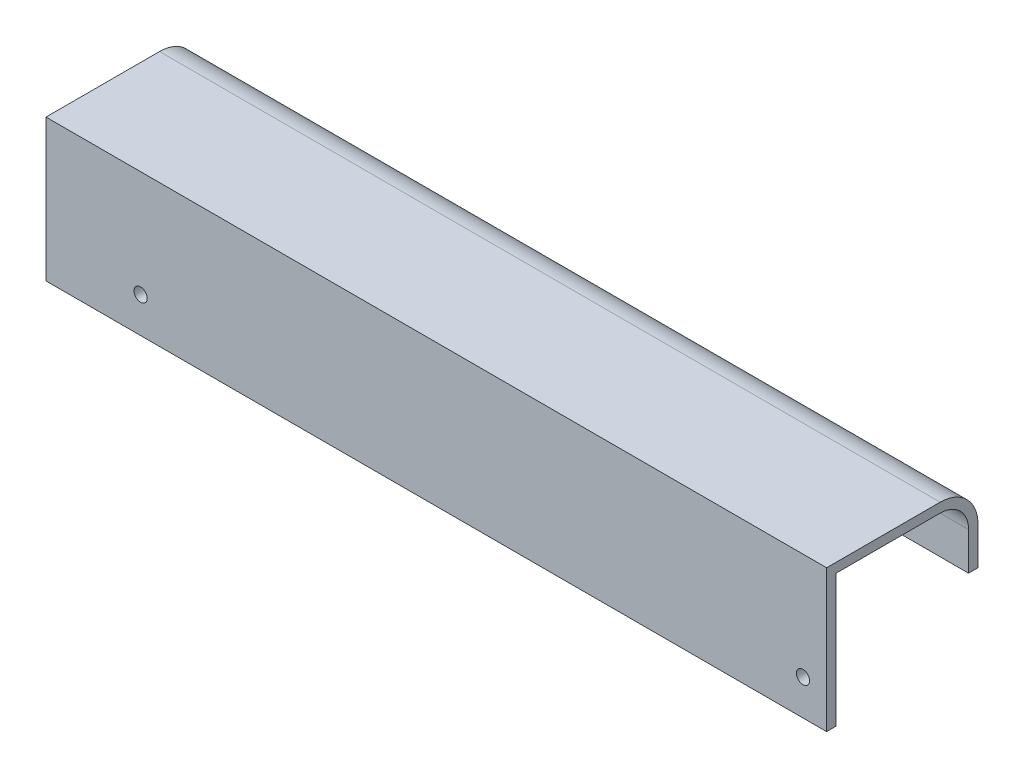
ISO-10303-21;
HEADER;
FILE_DESCRIPTION(('STEP AP214'),'2;1');
FILE_NAME('part.step','',(''),(''),'','','');
FILE_SCHEMA(('AUTOMOTIVE_DESIGN { 1 0 10303 214 1 1 1 1 }'));
ENDSEC;
DATA;
#1=APPLICATION_CONTEXT('core data for automotive mechanical design processes');
#2=APPLICATION_PROTOCOL_DEFINITION('international standard','automotive_design',2000,#1);
#3=PRODUCT_CONTEXT('',#1,'mechanical');
#4=PRODUCT('Part','Part','',(#3));
#5=PRODUCT_RELATED_PRODUCT_CATEGORY('part','',(#4));
#6=PRODUCT_DEFINITION_FORMATION('','',#4);
#7=PRODUCT_DEFINITION_CONTEXT('part definition',#1,'design');
#8=PRODUCT_DEFINITION('design','',#6,#7);
#9=PRODUCT_DEFINITION_SHAPE('','',#8);
#10=(LENGTH_UNIT() NAMED_UNIT(*) SI_UNIT(.MILLI.,.METRE.));
#11=(NAMED_UNIT(*) PLANE_ANGLE_UNIT() SI_UNIT($,.RADIAN.));
#12=(NAMED_UNIT(*) SI_UNIT($,.STERADIAN.) SOLID_ANGLE_UNIT());
#13=UNCERTAINTY_MEASURE_WITH_UNIT(LENGTH_MEASURE(1.E-05),#10,'distance_accuracy_value','');
#14=(GEOMETRIC_REPRESENTATION_CONTEXT(3) GLOBAL_UNCERTAINTY_ASSIGNED_CONTEXT((#13)) GLOBAL_UNIT_ASSIGNED_CONTEXT((#10,
#11,#12)) REPRESENTATION_CONTEXT('',''));
#15=CARTESIAN_POINT('',(0.,0.,0.));
#16=DIRECTION('',(0.,0.,1.));
#17=DIRECTION('',(1.,0.,0.));
#18=AXIS2_PLACEMENT_3D('',#15,#16,#17);
#19=CARTESIAN_POINT('',(-139.7,10.16,-35.56));
#20=DIRECTION('',(0.,0.,-1.));
#21=DIRECTION('',(0.,1.,0.));
#22=AXIS2_PLACEMENT_3D('',#19,#20,#21);
#23=PLANE('',#22);
#24=DIRECTION('',(0.,-1.,0.));
#25=VECTOR('',#24,1.);
#26=CARTESIAN_POINT('',(-190.5,10.16,-35.56));
#27=LINE('',#26,#25);
#28=CARTESIAN_POINT('',(-190.5,10.16,-35.56));
#29=VERTEX_POINT('',#28);
#30=CARTESIAN_POINT('',(-190.5,0.,-35.56));
#31=VERTEX_POINT('',#30);
#32=EDGE_CURVE('E140',#29,#31,#27,.T.);
#33=ORIENTED_EDGE('',*,*,#32,.F.);
#34=DIRECTION('',(-1.,0.,0.));
#35=VECTOR('',#34,1.);
#36=CARTESIAN_POINT('',(-139.7,10.16,-35.56));
#37=LINE('',#36,#35);
#38=CARTESIAN_POINT('',(-139.7,10.16,-35.56));
#39=VERTEX_POINT('',#38);
#40=EDGE_CURVE('E12',#39,#29,#37,.T.);
#41=ORIENTED_EDGE('',*,*,#40,.F.);
#42=DIRECTION('',(0.,-1.,0.));
#43=VECTOR('',#42,1.);
#44=CARTESIAN_POINT('',(-139.7,10.16,-35.56));
#45=LINE('',#44,#43);
#46=CARTESIAN_POINT('',(-139.7,0.,-35.56));
#47=VERTEX_POINT('',#46);
#48=EDGE_CURVE('E157',#39,#47,#45,.T.);
#49=ORIENTED_EDGE('',*,*,#48,.T.);
#50=DIRECTION('',(-1.,0.,0.));
#51=VECTOR('',#50,1.);
#52=CARTESIAN_POINT('',(-139.7,0.,-35.56));
#53=LINE('',#52,#51);
#54=EDGE_CURVE('E52',#47,#31,#53,.T.);
#55=ORIENTED_EDGE('',*,*,#54,.T.);
#56=EDGE_LOOP('',(#33,#41,#49,#55));
#57=FACE_BOUND('',#56,.T.);
#58=ADVANCED_FACE('F49',(#57),#23,.T.);
#59=CARTESIAN_POINT('',(-139.7,10.16,-27.94));
#60=DIRECTION('',(-1.,0.,0.));
#61=DIRECTION('',(0.,0.,1.));
#62=AXIS2_PLACEMENT_3D('',#59,#60,#61);
#63=CYLINDRICAL_SURFACE('',#62,7.62);
#64=CARTESIAN_POINT('',(-190.5,10.16,-27.94));
#65=DIRECTION('',(-1.,0.,0.));
#66=DIRECTION('',(0.,0.,1.));
#67=AXIS2_PLACEMENT_3D('',#64,#65,#66);
#68=CIRCLE('',#67,7.62);
#69=CARTESIAN_POINT('',(-190.5,17.78,-27.94));
#70=VERTEX_POINT('',#69);
#71=EDGE_CURVE('E155',#70,#29,#68,.T.);
#72=ORIENTED_EDGE('',*,*,#71,.F.);
#73=DIRECTION('',(-1.,0.,0.));
#74=VECTOR('',#73,1.);
#75=CARTESIAN_POINT('',(-139.7,17.78,-27.94));
#76=LINE('',#75,#74);
#77=CARTESIAN_POINT('',(-139.7,17.78,-27.94));
#78=VERTEX_POINT('',#77);
#79=EDGE_CURVE('E58',#78,#70,#76,.T.);
#80=ORIENTED_EDGE('',*,*,#79,.F.);
#81=CARTESIAN_POINT('',(-139.7,10.16,-27.94));
#82=DIRECTION('',(-1.,0.,0.));
#83=DIRECTION('',(0.,0.,1.));
#84=AXIS2_PLACEMENT_3D('',#81,#82,#83);
#85=CIRCLE('',#84,7.62);
#86=EDGE_CURVE('E130',#78,#39,#85,.T.);
#87=ORIENTED_EDGE('',*,*,#86,.T.);
#88=ORIENTED_EDGE('',*,*,#40,.T.);
#89=EDGE_LOOP('',(#72,#80,#87,#88));
#90=FACE_BOUND('',#89,.T.);
#91=ADVANCED_FACE('F167',(#90),#63,.T.);
#92=CARTESIAN_POINT('',(-139.7,17.78,0.));
#93=DIRECTION('',(0.,1.,0.));
#94=DIRECTION('',(0.,0.,1.));
#95=AXIS2_PLACEMENT_3D('',#92,#93,#94);
#96=PLANE('',#95);
#97=DIRECTION('',(0.,0.,-1.));
#98=VECTOR('',#97,1.);
#99=CARTESIAN_POINT('',(-190.5,17.78,0.));
#100=LINE('',#99,#98);
#101=CARTESIAN_POINT('',(-190.5,17.78,0.));
#102=VERTEX_POINT('',#101);
#103=EDGE_CURVE('E117',#102,#70,#100,.T.);
#104=ORIENTED_EDGE('',*,*,#103,.F.);
#105=DIRECTION('',(-1.,0.,0.));
#106=VECTOR('',#105,1.);
#107=CARTESIAN_POINT('',(-139.7,17.78,0.));
#108=LINE('',#107,#106);
#109=CARTESIAN_POINT('',(-139.7,17.78,0.));
#110=VERTEX_POINT('',#109);
#111=EDGE_CURVE('E112',#110,#102,#108,.T.);
#112=ORIENTED_EDGE('',*,*,#111,.F.);
#113=DIRECTION('',(0.,0.,-1.));
#114=VECTOR('',#113,1.);
#115=CARTESIAN_POINT('',(-139.7,17.78,0.));
#116=LINE('',#115,#114);
#117=EDGE_CURVE('E115',#110,#78,#116,.T.);
#118=ORIENTED_EDGE('',*,*,#117,.T.);
#119=ORIENTED_EDGE('',*,*,#79,.T.);
#120=EDGE_LOOP('',(#104,#112,#118,#119));
#121=FACE_BOUND('',#120,.T.);
#122=ADVANCED_FACE('F114',(#121),#96,.T.);
#123=CARTESIAN_POINT('',(-139.7,0.,0.));
#124=DIRECTION('',(0.,0.,1.));
#125=DIRECTION('',(1.,0.,0.));
#126=AXIS2_PLACEMENT_3D('',#123,#124,#125);
#127=PLANE('',#126);
#128=DIRECTION('',(0.,1.,0.));
#129=VECTOR('',#128,1.);
#130=CARTESIAN_POINT('',(-190.5,0.,0.));
#131=LINE('',#130,#129);
#132=CARTESIAN_POINT('',(-190.5,0.,0.));
#133=VERTEX_POINT('',#132);
#134=EDGE_CURVE('E152',#133,#102,#131,.T.);
#135=ORIENTED_EDGE('',*,*,#134,.F.);
#136=DIRECTION('',(-1.,0.,0.));
#137=VECTOR('',#136,1.);
#138=CARTESIAN_POINT('',(-139.7,0.,0.));
#139=LINE('',#138,#137);
#140=CARTESIAN_POINT('',(-139.7,0.,0.));
#141=VERTEX_POINT('',#140);
#142=EDGE_CURVE('E122',#141,#133,#139,.T.);
#143=ORIENTED_EDGE('',*,*,#142,.F.);
#144=DIRECTION('',(0.,1.,0.));
#145=VECTOR('',#144,1.);
#146=CARTESIAN_POINT('',(-139.7,0.,0.));
#147=LINE('',#146,#145);
#148=EDGE_CURVE('E128',#141,#110,#147,.T.);
#149=ORIENTED_EDGE('',*,*,#148,.T.);
#150=ORIENTED_EDGE('',*,*,#111,.T.);
#151=EDGE_LOOP('',(#135,#143,#149,#150));
#152=FACE_BOUND('',#151,.T.);
#153=ADVANCED_FACE('F132',(#152),#127,.T.);
#154=CARTESIAN_POINT('',(-139.7,0.,-5.07999999999998));
#155=DIRECTION('',(0.,-1.,0.));
#156=DIRECTION('',(0.,0.,-1.));
#157=AXIS2_PLACEMENT_3D('',#154,#155,#156);
#158=PLANE('',#157);
#159=DIRECTION('',(0.,0.,1.));
#160=VECTOR('',#159,1.);
#161=CARTESIAN_POINT('',(-190.5,0.,-5.07999999999998));
#162=LINE('',#161,#160);
#163=CARTESIAN_POINT('',(-190.5,0.,-5.07999999999998));
#164=VERTEX_POINT('',#163);
#165=EDGE_CURVE('E149',#164,#133,#162,.T.);
#166=ORIENTED_EDGE('',*,*,#165,.F.);
#167=DIRECTION('',(-1.,0.,0.));
#168=VECTOR('',#167,1.);
#169=CARTESIAN_POINT('',(-139.7,0.,-5.07999999999998));
#170=LINE('',#169,#168);
#171=CARTESIAN_POINT('',(-139.7,0.,-5.07999999999998));
#172=VERTEX_POINT('',#171);
#173=EDGE_CURVE('E161',#172,#164,#170,.T.);
#174=ORIENTED_EDGE('',*,*,#173,.F.);
#175=DIRECTION('',(0.,0.,1.));
#176=VECTOR('',#175,1.);
#177=CARTESIAN_POINT('',(-139.7,0.,-5.07999999999998));
#178=LINE('',#177,#176);
#179=EDGE_CURVE('E133',#172,#141,#178,.T.);
#180=ORIENTED_EDGE('',*,*,#179,.T.);
#181=ORIENTED_EDGE('',*,*,#142,.T.);
#182=EDGE_LOOP('',(#166,#174,#180,#181));
#183=FACE_BOUND('',#182,.T.);
#184=ADVANCED_FACE('F180',(#183),#158,.T.);
#185=CARTESIAN_POINT('',(-139.7,0.,-17.78));
#186=DIRECTION('',(1.,0.,0.));
#187=DIRECTION('',(0.,-1.,0.));
#188=AXIS2_PLACEMENT_3D('',#185,#186,#187);
#189=ELLIPSE('',#188,12.7,12.7);
#190=DIRECTION('',(-1.,0.,0.));
#191=VECTOR('',#190,1.);
#192=SURFACE_OF_LINEAR_EXTRUSION('',#189,#191);
#193=CARTESIAN_POINT('',(-190.5,0.,-17.78));
#194=DIRECTION('',(1.,0.,0.));
#195=DIRECTION('',(0.,-1.,0.));
#196=AXIS2_PLACEMENT_3D('',#193,#194,#195);
#197=ELLIPSE('',#196,12.7,12.7);
#198=CARTESIAN_POINT('',(-190.5,0.,-30.48));
#199=VERTEX_POINT('',#198);
#200=EDGE_CURVE('E146',#199,#164,#197,.T.);
#201=ORIENTED_EDGE('',*,*,#200,.F.);
#202=DIRECTION('',(-1.,0.,0.));
#203=VECTOR('',#202,1.);
#204=CARTESIAN_POINT('',(-139.7,0.,-30.48));
#205=LINE('',#204,#203);
#206=CARTESIAN_POINT('',(-139.7,0.,-30.48));
#207=VERTEX_POINT('',#206);
#208=EDGE_CURVE('E162',#207,#199,#205,.T.);
#209=ORIENTED_EDGE('',*,*,#208,.F.);
#210=EDGE_CURVE('E135',#207,#172,#189,.T.);
#211=ORIENTED_EDGE('',*,*,#210,.T.);
#212=ORIENTED_EDGE('',*,*,#173,.T.);
#213=EDGE_LOOP('',(#201,#209,#211,#212));
#214=FACE_BOUND('',#213,.T.);
#215=ADVANCED_FACE('F183',(#214),#192,.T.);
#216=CARTESIAN_POINT('',(-139.7,0.,-35.56));
#217=DIRECTION('',(0.,-1.,0.));
#218=DIRECTION('',(0.,0.,-1.));
#219=AXIS2_PLACEMENT_3D('',#216,#217,#218);
#220=PLANE('',#219);
#221=DIRECTION('',(0.,0.,1.));
#222=VECTOR('',#221,1.);
#223=CARTESIAN_POINT('',(-190.5,0.,-35.56));
#224=LINE('',#223,#222);
#225=EDGE_CURVE('E143',#31,#199,#224,.T.);
#226=ORIENTED_EDGE('',*,*,#225,.F.);
#227=ORIENTED_EDGE('',*,*,#54,.F.);
#228=DIRECTION('',(0.,0.,1.));
#229=VECTOR('',#228,1.);
#230=CARTESIAN_POINT('',(-139.7,0.,-35.56));
#231=LINE('',#230,#229);
#232=EDGE_CURVE('E190',#47,#207,#231,.T.);
#233=ORIENTED_EDGE('',*,*,#232,.T.);
#234=ORIENTED_EDGE('',*,*,#208,.T.);
#235=EDGE_LOOP('',(#226,#227,#233,#234));
#236=FACE_BOUND('',#235,.T.);
#237=ADVANCED_FACE('F164',(#236),#220,.T.);
#238=CARTESIAN_POINT('',(-139.7,0.,-17.78));
#239=DIRECTION('',(-1.,0.,0.));
#240=DIRECTION('',(0.,0.,1.));
#241=AXIS2_PLACEMENT_3D('',#238,#239,#240);
#242=PLANE('',#241);
#243=ORIENTED_EDGE('',*,*,#48,.F.);
#244=ORIENTED_EDGE('',*,*,#86,.F.);
#245=ORIENTED_EDGE('',*,*,#117,.F.);
#246=ORIENTED_EDGE('',*,*,#148,.F.);
#247=ORIENTED_EDGE('',*,*,#179,.F.);
#248=ORIENTED_EDGE('',*,*,#210,.F.);
#249=ORIENTED_EDGE('',*,*,#232,.F.);
#250=EDGE_LOOP('',(#243,#244,#245,#246,#247,#248,#249));
#251=FACE_BOUND('',#250,.T.);
#252=ADVANCED_FACE('F126',(#251),#242,.F.);
#253=CARTESIAN_POINT('',(-190.5,0.,-17.78));
#254=DIRECTION('',(-1.,0.,0.));
#255=DIRECTION('',(0.,0.,1.));
#256=AXIS2_PLACEMENT_3D('',#253,#254,#255);
#257=PLANE('',#256);
#258=ORIENTED_EDGE('',*,*,#32,.T.);
#259=ORIENTED_EDGE('',*,*,#225,.T.);
#260=ORIENTED_EDGE('',*,*,#200,.T.);
#261=ORIENTED_EDGE('',*,*,#165,.T.);
#262=ORIENTED_EDGE('',*,*,#134,.T.);
#263=ORIENTED_EDGE('',*,*,#103,.T.);
#264=ORIENTED_EDGE('',*,*,#71,.T.);
#265=EDGE_LOOP('',(#258,#259,#260,#261,#262,#263,#264));
#266=FACE_BOUND('',#265,.T.);
#267=ADVANCED_FACE('F166',(#266),#257,.T.);
#268=CLOSED_SHELL('',(#58,#91,#122,#153,#184,#215,#237,#252,#267));
#269=MANIFOLD_SOLID_BREP('B2',#268);
#270=CARTESIAN_POINT('',(-190.5,20.32,0.));
#271=DIRECTION('',(1.,0.,0.));
#272=DIRECTION('',(0.,0.,-1.));
#273=AXIS2_PLACEMENT_3D('',#270,#271,#272);
#274=PLANE('',#273);
#275=DIRECTION('',(0.,0.,1.));
#276=VECTOR('',#275,1.);
#277=CARTESIAN_POINT('',(-190.5,17.78,0.));
#278=LINE('',#277,#276);
#279=CARTESIAN_POINT('',(-190.5,17.78,-27.94));
#280=VERTEX_POINT('',#279);
#281=CARTESIAN_POINT('',(-190.5,17.78,0.));
#282=VERTEX_POINT('',#281);
#283=EDGE_CURVE('E338',#280,#282,#278,.T.);
#284=ORIENTED_EDGE('',*,*,#283,.T.);
#285=DIRECTION('',(0.,-1.,0.));
#286=VECTOR('',#285,1.);
#287=CARTESIAN_POINT('',(-190.5,20.32,0.));
#288=LINE('',#287,#286);
#289=CARTESIAN_POINT('',(-190.5,-17.78,0.));
#290=VERTEX_POINT('',#289);
#291=EDGE_CURVE('E391',#282,#290,#288,.T.);
#292=ORIENTED_EDGE('',*,*,#291,.T.);
#293=DIRECTION('',(0.,0.,-1.));
#294=VECTOR('',#293,1.);
#295=CARTESIAN_POINT('',(-190.5,-17.78,2.54));
#296=LINE('',#295,#294);
#297=CARTESIAN_POINT('',(-190.5,-17.78,2.54));
#298=VERTEX_POINT('',#297);
#299=EDGE_CURVE('E352',#298,#290,#296,.T.);
#300=ORIENTED_EDGE('',*,*,#299,.F.);
#301=DIRECTION('',(0.,-1.,0.));
#302=VECTOR('',#301,1.);
#303=CARTESIAN_POINT('',(-190.5,20.32,2.54));
#304=LINE('',#303,#302);
#305=CARTESIAN_POINT('',(-190.5,20.32,2.54));
#306=VERTEX_POINT('',#305);
#307=EDGE_CURVE('E382',#306,#298,#304,.T.);
#308=ORIENTED_EDGE('',*,*,#307,.F.);
#309=DIRECTION('',(0.,0.,1.));
#310=VECTOR('',#309,1.);
#311=CARTESIAN_POINT('',(-190.5,20.32,0.));
#312=LINE('',#311,#310);
#313=CARTESIAN_POINT('',(-190.5,20.32,-27.94));
#314=VERTEX_POINT('',#313);
#315=EDGE_CURVE('E364',#314,#306,#312,.T.);
#316=ORIENTED_EDGE('',*,*,#315,.F.);
#317=CARTESIAN_POINT('',(-190.5,10.16,-27.94));
#318=DIRECTION('',(1.,0.,0.));
#319=DIRECTION('',(0.,0.,-1.));
#320=AXIS2_PLACEMENT_3D('',#317,#318,#319);
#321=CIRCLE('',#320,10.16);
#322=CARTESIAN_POINT('',(-190.5,10.16,-38.1));
#323=VERTEX_POINT('',#322);
#324=EDGE_CURVE('E274',#314,#323,#321,.F.);
#325=ORIENTED_EDGE('',*,*,#324,.T.);
#326=DIRECTION('',(0.,-1.,0.));
#327=VECTOR('',#326,1.);
#328=CARTESIAN_POINT('',(-190.5,20.32,-38.1));
#329=LINE('',#328,#327);
#330=CARTESIAN_POINT('',(-190.5,0.,-38.1));
#331=VERTEX_POINT('',#330);
#332=EDGE_CURVE('E350',#323,#331,#329,.T.);
#333=ORIENTED_EDGE('',*,*,#332,.T.);
#334=DIRECTION('',(0.,0.,1.));
#335=VECTOR('',#334,1.);
#336=CARTESIAN_POINT('',(-190.5,0.,0.));
#337=LINE('',#336,#335);
#338=CARTESIAN_POINT('',(-190.5,0.,-35.56));
#339=VERTEX_POINT('',#338);
#340=EDGE_CURVE('E345',#331,#339,#337,.T.);
#341=ORIENTED_EDGE('',*,*,#340,.T.);
#342=DIRECTION('',(0.,-1.,0.));
#343=VECTOR('',#342,1.);
#344=CARTESIAN_POINT('',(-190.5,20.32,-35.56));
#345=LINE('',#344,#343);
#346=CARTESIAN_POINT('',(-190.5,10.16,-35.56));
#347=VERTEX_POINT('',#346);
#348=EDGE_CURVE('E328',#347,#339,#345,.T.);
#349=ORIENTED_EDGE('',*,*,#348,.F.);
#350=CARTESIAN_POINT('',(-190.5,10.16,-27.94));
#351=DIRECTION('',(1.,0.,0.));
#352=DIRECTION('',(0.,0.,-1.));
#353=AXIS2_PLACEMENT_3D('',#350,#351,#352);
#354=CIRCLE('',#353,7.62);
#355=EDGE_CURVE('E412',#280,#347,#354,.F.);
#356=ORIENTED_EDGE('',*,*,#355,.F.);
#357=EDGE_LOOP('',(#284,#292,#300,#308,#316,#325,#333,#341,#349,#356));
#358=FACE_BOUND('',#357,.T.);
#359=ADVANCED_FACE('F252',(#358),#274,.F.);
#360=CARTESIAN_POINT('',(19.0500000000001,20.32,0.));
#361=DIRECTION('',(-1.,0.,0.));
#362=DIRECTION('',(0.,0.,1.));
#363=AXIS2_PLACEMENT_3D('',#360,#361,#362);
#364=PLANE('',#363);
#365=DIRECTION('',(0.,1.,0.));
#366=VECTOR('',#365,1.);
#367=CARTESIAN_POINT('',(19.0500000000001,20.32,0.));
#368=LINE('',#367,#366);
#369=CARTESIAN_POINT('',(19.0500000000001,-17.78,0.));
#370=VERTEX_POINT('',#369);
#371=CARTESIAN_POINT('',(19.0500000000001,17.78,0.));
#372=VERTEX_POINT('',#371);
#373=EDGE_CURVE('E387',#370,#372,#368,.T.);
#374=ORIENTED_EDGE('',*,*,#373,.T.);
#375=DIRECTION('',(0.,0.,1.));
#376=VECTOR('',#375,1.);
#377=CARTESIAN_POINT('',(19.0500000000001,17.78,0.));
#378=LINE('',#377,#376);
#379=CARTESIAN_POINT('',(19.0500000000001,17.78,-27.94));
#380=VERTEX_POINT('',#379);
#381=EDGE_CURVE('E419',#380,#372,#378,.T.);
#382=ORIENTED_EDGE('',*,*,#381,.F.);
#383=CARTESIAN_POINT('',(19.0500000000001,10.16,-27.94));
#384=DIRECTION('',(-1.,0.,0.));
#385=DIRECTION('',(0.,0.,1.));
#386=AXIS2_PLACEMENT_3D('',#383,#384,#385);
#387=CIRCLE('',#386,7.62);
#388=CARTESIAN_POINT('',(19.0500000000001,10.16,-35.56));
#389=VERTEX_POINT('',#388);
#390=EDGE_CURVE('E347',#389,#380,#387,.F.);
#391=ORIENTED_EDGE('',*,*,#390,.F.);
#392=DIRECTION('',(0.,1.,0.));
#393=VECTOR('',#392,1.);
#394=CARTESIAN_POINT('',(19.0500000000001,0.,-35.56));
#395=LINE('',#394,#393);
#396=CARTESIAN_POINT('',(19.0500000000001,0.,-35.56));
#397=VERTEX_POINT('',#396);
#398=EDGE_CURVE('E422',#397,#389,#395,.T.);
#399=ORIENTED_EDGE('',*,*,#398,.F.);
#400=DIRECTION('',(0.,0.,-1.));
#401=VECTOR('',#400,1.);
#402=CARTESIAN_POINT('',(19.0500000000001,0.,0.));
#403=LINE('',#402,#401);
#404=CARTESIAN_POINT('',(19.0500000000001,0.,-38.1));
#405=VERTEX_POINT('',#404);
#406=EDGE_CURVE('E346',#397,#405,#403,.T.);
#407=ORIENTED_EDGE('',*,*,#406,.T.);
#408=DIRECTION('',(0.,-1.,0.));
#409=VECTOR('',#408,1.);
#410=CARTESIAN_POINT('',(19.0500000000001,20.32,-38.1));
#411=LINE('',#410,#409);
#412=CARTESIAN_POINT('',(19.0500000000001,10.16,-38.1));
#413=VERTEX_POINT('',#412);
#414=EDGE_CURVE('E366',#413,#405,#411,.T.);
#415=ORIENTED_EDGE('',*,*,#414,.F.);
#416=CARTESIAN_POINT('',(19.0500000000001,10.16,-27.94));
#417=DIRECTION('',(-1.,0.,0.));
#418=DIRECTION('',(0.,0.,1.));
#419=AXIS2_PLACEMENT_3D('',#416,#417,#418);
#420=CIRCLE('',#419,10.16);
#421=CARTESIAN_POINT('',(19.0500000000001,20.32,-27.94));
#422=VERTEX_POINT('',#421);
#423=EDGE_CURVE('E47',#413,#422,#420,.F.);
#424=ORIENTED_EDGE('',*,*,#423,.T.);
#425=DIRECTION('',(0.,0.,-1.));
#426=VECTOR('',#425,1.);
#427=CARTESIAN_POINT('',(19.0500000000001,20.32,0.));
#428=LINE('',#427,#426);
#429=CARTESIAN_POINT('',(19.0500000000001,20.32,2.54));
#430=VERTEX_POINT('',#429);
#431=EDGE_CURVE('E360',#430,#422,#428,.T.);
#432=ORIENTED_EDGE('',*,*,#431,.F.);
#433=DIRECTION('',(0.,1.,0.));
#434=VECTOR('',#433,1.);
#435=CARTESIAN_POINT('',(19.0500000000001,20.32,2.54));
#436=LINE('',#435,#434);
#437=CARTESIAN_POINT('',(19.0500000000001,-17.78,2.54));
#438=VERTEX_POINT('',#437);
#439=EDGE_CURVE('E395',#438,#430,#436,.T.);
#440=ORIENTED_EDGE('',*,*,#439,.F.);
#441=DIRECTION('',(0.,0.,-1.));
#442=VECTOR('',#441,1.);
#443=CARTESIAN_POINT('',(19.0500000000001,-17.78,2.54));
#444=LINE('',#443,#442);
#445=EDGE_CURVE('E357',#438,#370,#444,.T.);
#446=ORIENTED_EDGE('',*,*,#445,.T.);
#447=EDGE_LOOP('',(#374,#382,#391,#399,#407,#415,#424,#432,#440,#446));
#448=FACE_BOUND('',#447,.T.);
#449=ADVANCED_FACE('F432',(#448),#364,.F.);
#450=CARTESIAN_POINT('',(-190.5,20.32,-38.1));
#451=DIRECTION('',(0.,0.,1.));
#452=DIRECTION('',(1.,0.,0.));
#453=AXIS2_PLACEMENT_3D('',#450,#451,#452);
#454=PLANE('',#453);
#455=ORIENTED_EDGE('',*,*,#332,.F.);
#456=DIRECTION('',(-1.,0.,0.));
#457=VECTOR('',#456,1.);
#458=CARTESIAN_POINT('',(-190.5,10.16,-38.1));
#459=LINE('',#458,#457);
#460=EDGE_CURVE('E260',#323,#413,#459,.F.);
#461=ORIENTED_EDGE('',*,*,#460,.T.);
#462=ORIENTED_EDGE('',*,*,#414,.T.);
#463=DIRECTION('',(-1.,0.,0.));
#464=VECTOR('',#463,1.);
#465=CARTESIAN_POINT('',(-190.5,0.,-38.1));
#466=LINE('',#465,#464);
#467=EDGE_CURVE('E354',#405,#331,#466,.T.);
#468=ORIENTED_EDGE('',*,*,#467,.T.);
#469=EDGE_LOOP('',(#455,#461,#462,#468));
#470=FACE_BOUND('',#469,.T.);
#471=ADVANCED_FACE('F459',(#470),#454,.F.);
#472=CARTESIAN_POINT('',(0.,20.32,0.));
#473=DIRECTION('',(0.,-1.,0.));
#474=DIRECTION('',(0.,0.,-1.));
#475=AXIS2_PLACEMENT_3D('',#472,#473,#474);
#476=PLANE('',#475);
#477=ORIENTED_EDGE('',*,*,#431,.T.);
#478=DIRECTION('',(-1.,0.,0.));
#479=VECTOR('',#478,1.);
#480=CARTESIAN_POINT('',(0.,20.32,-27.94));
#481=LINE('',#480,#479);
#482=EDGE_CURVE('E368',#422,#314,#481,.T.);
#483=ORIENTED_EDGE('',*,*,#482,.T.);
#484=ORIENTED_EDGE('',*,*,#315,.T.);
#485=DIRECTION('',(-1.,0.,0.));
#486=VECTOR('',#485,1.);
#487=CARTESIAN_POINT('',(-190.5,20.32,2.54));
#488=LINE('',#487,#486);
#489=EDGE_CURVE('E386',#430,#306,#488,.T.);
#490=ORIENTED_EDGE('',*,*,#489,.F.);
#491=EDGE_LOOP('',(#477,#483,#484,#490));
#492=FACE_BOUND('',#491,.T.);
#493=ADVANCED_FACE('F374',(#492),#476,.F.);
#494=CARTESIAN_POINT('',(0.,0.,0.));
#495=DIRECTION('',(0.,-1.,0.));
#496=DIRECTION('',(0.,0.,-1.));
#497=AXIS2_PLACEMENT_3D('',#494,#495,#496);
#498=PLANE('',#497);
#499=DIRECTION('',(-1.,0.,0.));
#500=VECTOR('',#499,1.);
#501=CARTESIAN_POINT('',(58.8072886399464,0.,-35.56));
#502=LINE('',#501,#500);
#503=EDGE_CURVE('E332',#397,#339,#502,.T.);
#504=ORIENTED_EDGE('',*,*,#503,.T.);
#505=ORIENTED_EDGE('',*,*,#340,.F.);
#506=ORIENTED_EDGE('',*,*,#467,.F.);
#507=ORIENTED_EDGE('',*,*,#406,.F.);
#508=EDGE_LOOP('',(#504,#505,#506,#507));
#509=FACE_BOUND('',#508,.T.);
#510=ADVANCED_FACE('F343',(#509),#498,.T.);
#511=CARTESIAN_POINT('',(0.,10.16,-27.94));
#512=DIRECTION('',(-1.,0.,0.));
#513=DIRECTION('',(0.,0.,1.));
#514=AXIS2_PLACEMENT_3D('',#511,#512,#513);
#515=CYLINDRICAL_SURFACE('',#514,10.16);
#516=ORIENTED_EDGE('',*,*,#423,.F.);
#517=ORIENTED_EDGE('',*,*,#460,.F.);
#518=ORIENTED_EDGE('',*,*,#324,.F.);
#519=ORIENTED_EDGE('',*,*,#482,.F.);
#520=EDGE_LOOP('',(#516,#517,#518,#519));
#521=FACE_BOUND('',#520,.T.);
#522=ADVANCED_FACE('F254',(#521),#515,.T.);
#523=CARTESIAN_POINT('',(0.,0.,0.));
#524=DIRECTION('',(0.,0.,1.));
#525=DIRECTION('',(1.,0.,0.));
#526=AXIS2_PLACEMENT_3D('',#523,#524,#525);
#527=PLANE('',#526);
#528=CARTESIAN_POINT('',(-165.1,-8.25500000000002,0.));
#529=DIRECTION('',(0.,0.,1.));
#530=DIRECTION('',(1.,0.,0.));
#531=AXIS2_PLACEMENT_3D('',#528,#529,#530);
#532=CIRCLE('',#531,1.77800000000001);
#533=CARTESIAN_POINT('',(-163.322,-8.25500000000002,0.));
#534=VERTEX_POINT('',#533);
#535=EDGE_CURVE('E401',#534,#534,#532,.T.);
#536=ORIENTED_EDGE('',*,*,#535,.T.);
#537=EDGE_LOOP('',(#536));
#538=FACE_BOUND('',#537,.T.);
#539=CARTESIAN_POINT('',(12.7000000000002,-8.25500000000002,0.));
#540=DIRECTION('',(0.,0.,1.));
#541=DIRECTION('',(1.,0.,0.));
#542=AXIS2_PLACEMENT_3D('',#539,#540,#541);
#543=CIRCLE('',#542,1.77800000000001);
#544=CARTESIAN_POINT('',(14.4780000000002,-8.25500000000002,0.));
#545=VERTEX_POINT('',#544);
#546=EDGE_CURVE('E407',#545,#545,#543,.T.);
#547=ORIENTED_EDGE('',*,*,#546,.T.);
#548=EDGE_LOOP('',(#547));
#549=FACE_BOUND('',#548,.T.);
#550=ORIENTED_EDGE('',*,*,#291,.F.);
#551=DIRECTION('',(-1.,0.,0.));
#552=VECTOR('',#551,1.);
#553=CARTESIAN_POINT('',(0.,17.78,0.));
#554=LINE('',#553,#552);
#555=EDGE_CURVE('E414',#372,#282,#554,.T.);
#556=ORIENTED_EDGE('',*,*,#555,.F.);
#557=ORIENTED_EDGE('',*,*,#373,.F.);
#558=DIRECTION('',(1.,0.,0.));
#559=VECTOR('',#558,1.);
#560=CARTESIAN_POINT('',(-190.5,-17.78,0.));
#561=LINE('',#560,#559);
#562=EDGE_CURVE('E389',#290,#370,#561,.T.);
#563=ORIENTED_EDGE('',*,*,#562,.F.);
#564=EDGE_LOOP('',(#550,#556,#557,#563));
#565=FACE_BOUND('',#564,.T.);
#566=ADVANCED_FACE('F439',(#538,#549,#565),#527,.F.);
#567=CARTESIAN_POINT('',(0.,0.,2.54));
#568=DIRECTION('',(0.,0.,1.));
#569=DIRECTION('',(1.,0.,0.));
#570=AXIS2_PLACEMENT_3D('',#567,#568,#569);
#571=PLANE('',#570);
#572=CARTESIAN_POINT('',(-165.1,-8.25500000000002,2.54));
#573=DIRECTION('',(0.,0.,1.));
#574=DIRECTION('',(1.,0.,0.));
#575=AXIS2_PLACEMENT_3D('',#572,#573,#574);
#576=CIRCLE('',#575,1.77800000000001);
#577=CARTESIAN_POINT('',(-163.322,-8.25500000000002,2.54));
#578=VERTEX_POINT('',#577);
#579=EDGE_CURVE('E393',#578,#578,#576,.T.);
#580=ORIENTED_EDGE('',*,*,#579,.F.);
#581=EDGE_LOOP('',(#580));
#582=FACE_BOUND('',#581,.T.);
#583=ORIENTED_EDGE('',*,*,#307,.T.);
#584=DIRECTION('',(1.,0.,0.));
#585=VECTOR('',#584,1.);
#586=CARTESIAN_POINT('',(-190.5,-17.78,2.54));
#587=LINE('',#586,#585);
#588=EDGE_CURVE('E398',#298,#438,#587,.T.);
#589=ORIENTED_EDGE('',*,*,#588,.T.);
#590=ORIENTED_EDGE('',*,*,#439,.T.);
#591=ORIENTED_EDGE('',*,*,#489,.T.);
#592=EDGE_LOOP('',(#583,#589,#590,#591));
#593=FACE_BOUND('',#592,.T.);
#594=CARTESIAN_POINT('',(12.7000000000002,-8.25500000000002,2.54));
#595=DIRECTION('',(0.,0.,1.));
#596=DIRECTION('',(1.,0.,0.));
#597=AXIS2_PLACEMENT_3D('',#594,#595,#596);
#598=CIRCLE('',#597,1.77800000000001);
#599=CARTESIAN_POINT('',(14.4780000000002,-8.25500000000002,2.54));
#600=VERTEX_POINT('',#599);
#601=EDGE_CURVE('E404',#600,#600,#598,.T.);
#602=ORIENTED_EDGE('',*,*,#601,.F.);
#603=EDGE_LOOP('',(#602));
#604=FACE_BOUND('',#603,.T.);
#605=ADVANCED_FACE('F445',(#582,#593,#604),#571,.T.);
#606=CARTESIAN_POINT('',(-190.5,-17.78,2.54));
#607=DIRECTION('',(0.,1.,0.));
#608=DIRECTION('',(0.,0.,1.));
#609=AXIS2_PLACEMENT_3D('',#606,#607,#608);
#610=PLANE('',#609);
#611=ORIENTED_EDGE('',*,*,#562,.T.);
#612=ORIENTED_EDGE('',*,*,#445,.F.);
#613=ORIENTED_EDGE('',*,*,#588,.F.);
#614=ORIENTED_EDGE('',*,*,#299,.T.);
#615=EDGE_LOOP('',(#611,#612,#613,#614));
#616=FACE_BOUND('',#615,.T.);
#617=ADVANCED_FACE('F442',(#616),#610,.F.);
#618=CARTESIAN_POINT('',(-165.1,-8.25500000000002,2.54));
#619=DIRECTION('',(0.,0.,-1.));
#620=DIRECTION('',(-1.,0.,0.));
#621=AXIS2_PLACEMENT_3D('',#618,#619,#620);
#622=CYLINDRICAL_SURFACE('',#621,1.77800000000001);
#623=ORIENTED_EDGE('',*,*,#579,.T.);
#624=EDGE_LOOP('',(#623));
#625=FACE_BOUND('',#624,.T.);
#626=ORIENTED_EDGE('',*,*,#535,.F.);
#627=EDGE_LOOP('',(#626));
#628=FACE_BOUND('',#627,.T.);
#629=ADVANCED_FACE('F467',(#625,#628),#622,.F.);
#630=CARTESIAN_POINT('',(12.7000000000002,-8.25500000000002,2.54));
#631=DIRECTION('',(0.,0.,-1.));
#632=DIRECTION('',(-1.,0.,0.));
#633=AXIS2_PLACEMENT_3D('',#630,#631,#632);
#634=CYLINDRICAL_SURFACE('',#633,1.77800000000001);
#635=ORIENTED_EDGE('',*,*,#601,.T.);
#636=EDGE_LOOP('',(#635));
#637=FACE_BOUND('',#636,.T.);
#638=ORIENTED_EDGE('',*,*,#546,.F.);
#639=EDGE_LOOP('',(#638));
#640=FACE_BOUND('',#639,.T.);
#641=ADVANCED_FACE('F474',(#637,#640),#634,.F.);
#642=CARTESIAN_POINT('',(-190.5,20.32,-35.56));
#643=DIRECTION('',(0.,0.,1.));
#644=DIRECTION('',(1.,0.,0.));
#645=AXIS2_PLACEMENT_3D('',#642,#643,#644);
#646=PLANE('',#645);
#647=ORIENTED_EDGE('',*,*,#348,.T.);
#648=ORIENTED_EDGE('',*,*,#503,.F.);
#649=ORIENTED_EDGE('',*,*,#398,.T.);
#650=DIRECTION('',(1.,0.,0.));
#651=VECTOR('',#650,1.);
#652=CARTESIAN_POINT('',(-190.5,10.16,-35.56));
#653=LINE('',#652,#651);
#654=EDGE_CURVE('E334',#347,#389,#653,.T.);
#655=ORIENTED_EDGE('',*,*,#654,.F.);
#656=EDGE_LOOP('',(#647,#648,#649,#655));
#657=FACE_BOUND('',#656,.T.);
#658=ADVANCED_FACE('F330',(#657),#646,.T.);
#659=CARTESIAN_POINT('',(0.,17.78,0.));
#660=DIRECTION('',(0.,-1.,0.));
#661=DIRECTION('',(0.,0.,-1.));
#662=AXIS2_PLACEMENT_3D('',#659,#660,#661);
#663=PLANE('',#662);
#664=DIRECTION('',(1.,0.,0.));
#665=VECTOR('',#664,1.);
#666=CARTESIAN_POINT('',(0.,17.78,-27.94));
#667=LINE('',#666,#665);
#668=EDGE_CURVE('E337',#380,#280,#667,.F.);
#669=ORIENTED_EDGE('',*,*,#668,.F.);
#670=ORIENTED_EDGE('',*,*,#381,.T.);
#671=ORIENTED_EDGE('',*,*,#555,.T.);
#672=ORIENTED_EDGE('',*,*,#283,.F.);
#673=EDGE_LOOP('',(#669,#670,#671,#672));
#674=FACE_BOUND('',#673,.T.);
#675=ADVANCED_FACE('F436',(#674),#663,.T.);
#676=CARTESIAN_POINT('',(0.,10.16,-27.94));
#677=DIRECTION('',(-1.,0.,0.));
#678=DIRECTION('',(0.,0.,1.));
#679=AXIS2_PLACEMENT_3D('',#676,#677,#678);
#680=CYLINDRICAL_SURFACE('',#679,7.62);
#681=ORIENTED_EDGE('',*,*,#654,.T.);
#682=ORIENTED_EDGE('',*,*,#390,.T.);
#683=ORIENTED_EDGE('',*,*,#668,.T.);
#684=ORIENTED_EDGE('',*,*,#355,.T.);
#685=EDGE_LOOP('',(#681,#682,#683,#684));
#686=FACE_BOUND('',#685,.T.);
#687=ADVANCED_FACE('F429',(#686),#680,.F.);
#688=CLOSED_SHELL('',(#359,#449,#471,#493,#510,#522,#566,#605,#617,#629,#641,#658,#675,#687));
#689=MANIFOLD_SOLID_BREP('B6',#688);
#690=ADVANCED_BREP_SHAPE_REPRESENTATION('',(#18,#269,#689),#14);
#691=SHAPE_DEFINITION_REPRESENTATION(#9,#690);
ENDSEC;
END-ISO-10303-21;
